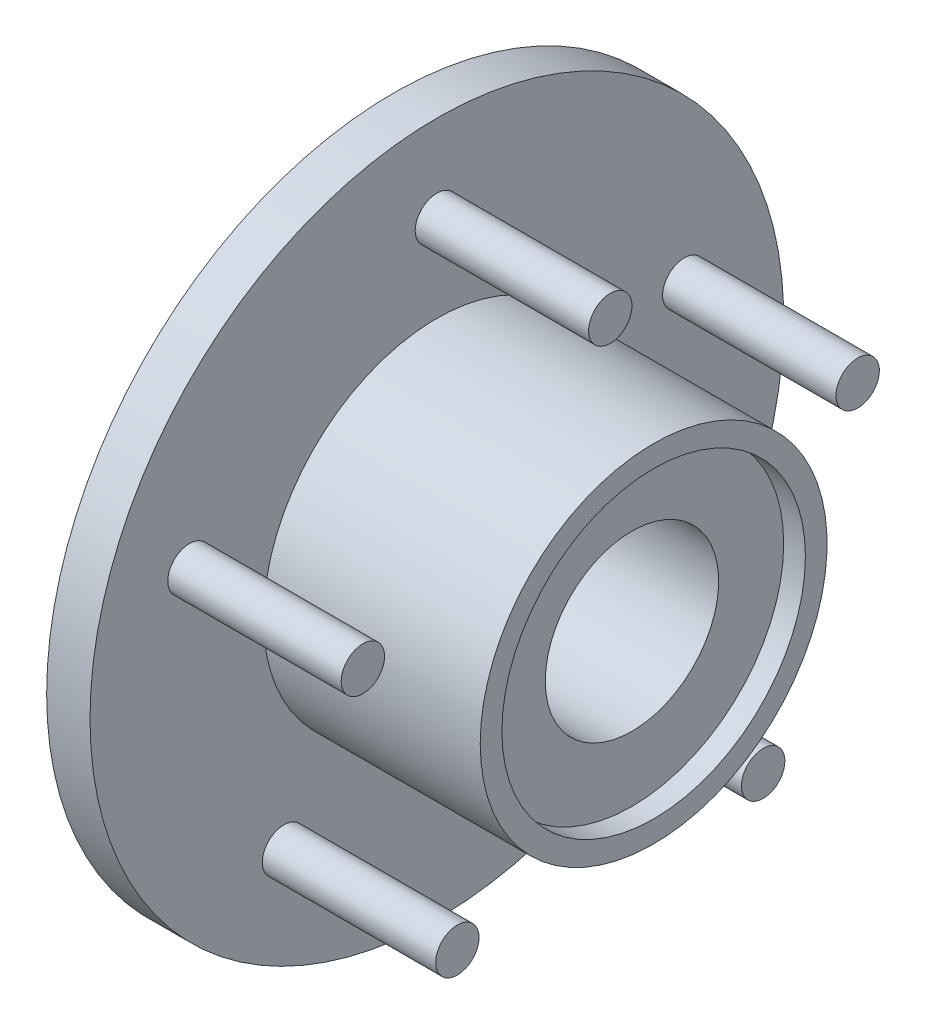
ISO-10303-21;
HEADER;
FILE_DESCRIPTION(('STEP AP214'),'2;1');
FILE_NAME('part.step','',(''),(''),'','','');
FILE_SCHEMA(('AUTOMOTIVE_DESIGN { 1 0 10303 214 1 1 1 1 }'));
ENDSEC;
DATA;
#1=APPLICATION_CONTEXT('core data for automotive mechanical design processes');
#2=APPLICATION_PROTOCOL_DEFINITION('international standard','automotive_design',2000,#1);
#3=PRODUCT_CONTEXT('',#1,'mechanical');
#4=PRODUCT('Part','Part','',(#3));
#5=PRODUCT_RELATED_PRODUCT_CATEGORY('part','',(#4));
#6=PRODUCT_DEFINITION_FORMATION('','',#4);
#7=PRODUCT_DEFINITION_CONTEXT('part definition',#1,'design');
#8=PRODUCT_DEFINITION('design','',#6,#7);
#9=PRODUCT_DEFINITION_SHAPE('','',#8);
#10=(LENGTH_UNIT() NAMED_UNIT(*) SI_UNIT(.MILLI.,.METRE.));
#11=(NAMED_UNIT(*) PLANE_ANGLE_UNIT() SI_UNIT($,.RADIAN.));
#12=(NAMED_UNIT(*) SI_UNIT($,.STERADIAN.) SOLID_ANGLE_UNIT());
#13=UNCERTAINTY_MEASURE_WITH_UNIT(LENGTH_MEASURE(1.E-05),#10,'distance_accuracy_value','');
#14=(GEOMETRIC_REPRESENTATION_CONTEXT(3) GLOBAL_UNCERTAINTY_ASSIGNED_CONTEXT((#13)) GLOBAL_UNIT_ASSIGNED_CONTEXT((#10,
#11,#12)) REPRESENTATION_CONTEXT('',''));
#15=CARTESIAN_POINT('',(0.,0.,0.));
#16=DIRECTION('',(0.,0.,1.));
#17=DIRECTION('',(1.,0.,0.));
#18=AXIS2_PLACEMENT_3D('',#15,#16,#17);
#19=CARTESIAN_POINT('',(19.05,-50.8,3.54734504026462E-13));
#20=DIRECTION('',(-1.,0.,0.));
#21=DIRECTION('',(0.,0.,1.));
#22=AXIS2_PLACEMENT_3D('',#19,#20,#21);
#23=PLANE('',#22);
#24=CARTESIAN_POINT('',(19.05,-30.8235474856853,22.3946181123435));
#25=DIRECTION('',(-1.,0.,0.));
#26=DIRECTION('',(0.,0.,1.));
#27=AXIS2_PLACEMENT_3D('',#24,#25,#26);
#28=CIRCLE('',#27,3.175);
#29=CARTESIAN_POINT('',(19.05,-30.8235474856853,25.5696181123435));
#30=VERTEX_POINT('',#29);
#31=EDGE_CURVE('E36',#30,#30,#28,.F.);
#32=ORIENTED_EDGE('',*,*,#31,.F.);
#33=EDGE_LOOP('',(#32));
#34=FACE_BOUND('',#33,.T.);
#35=CARTESIAN_POINT('',(19.05,11.7735474856854,-36.2352532708454));
#36=DIRECTION('',(-1.,0.,0.));
#37=DIRECTION('',(0.,0.,1.));
#38=AXIS2_PLACEMENT_3D('',#35,#36,#37);
#39=CIRCLE('',#38,3.175);
#40=CARTESIAN_POINT('',(19.05,11.7735474856854,-33.0602532708454));
#41=VERTEX_POINT('',#40);
#42=EDGE_CURVE('E44',#41,#41,#39,.F.);
#43=ORIENTED_EDGE('',*,*,#42,.F.);
#44=EDGE_LOOP('',(#43));
#45=FACE_BOUND('',#44,.T.);
#46=CARTESIAN_POINT('',(19.05,0.,0.));
#47=DIRECTION('',(-1.,0.,0.));
#48=DIRECTION('',(0.,0.,1.));
#49=AXIS2_PLACEMENT_3D('',#46,#47,#48);
#50=CIRCLE('',#49,25.4);
#51=CARTESIAN_POINT('',(19.05,0.,25.4));
#52=VERTEX_POINT('',#51);
#53=EDGE_CURVE('E73',#52,#52,#50,.T.);
#54=ORIENTED_EDGE('',*,*,#53,.T.);
#55=EDGE_LOOP('',(#54));
#56=FACE_BOUND('',#55,.T.);
#57=CARTESIAN_POINT('',(19.05,0.,0.));
#58=DIRECTION('',(-1.,0.,0.));
#59=DIRECTION('',(0.,0.,1.));
#60=AXIS2_PLACEMENT_3D('',#57,#58,#59);
#61=CIRCLE('',#60,50.8);
#62=CARTESIAN_POINT('',(19.05,0.,50.8));
#63=VERTEX_POINT('',#62);
#64=EDGE_CURVE('E76',#63,#63,#61,.T.);
#65=ORIENTED_EDGE('',*,*,#64,.F.);
#66=EDGE_LOOP('',(#65));
#67=FACE_BOUND('',#66,.T.);
#68=CARTESIAN_POINT('',(19.05,38.1,0.));
#69=DIRECTION('',(-1.,0.,0.));
#70=DIRECTION('',(0.,0.,1.));
#71=AXIS2_PLACEMENT_3D('',#68,#69,#70);
#72=CIRCLE('',#71,3.175);
#73=CARTESIAN_POINT('',(19.05,38.1,3.175));
#74=VERTEX_POINT('',#73);
#75=EDGE_CURVE('E49',#74,#74,#72,.F.);
#76=ORIENTED_EDGE('',*,*,#75,.F.);
#77=EDGE_LOOP('',(#76));
#78=FACE_BOUND('',#77,.T.);
#79=CARTESIAN_POINT('',(19.05,-30.8235474856856,-22.394618112343));
#80=DIRECTION('',(-1.,0.,0.));
#81=DIRECTION('',(0.,0.,1.));
#82=AXIS2_PLACEMENT_3D('',#79,#80,#81);
#83=CIRCLE('',#82,3.175);
#84=CARTESIAN_POINT('',(19.05,-30.8235474856856,-19.2196181123431));
#85=VERTEX_POINT('',#84);
#86=EDGE_CURVE('E40',#85,#85,#83,.F.);
#87=ORIENTED_EDGE('',*,*,#86,.F.);
#88=EDGE_LOOP('',(#87));
#89=FACE_BOUND('',#88,.T.);
#90=CARTESIAN_POINT('',(19.05,11.7735474856859,36.2352532708452));
#91=DIRECTION('',(-1.,0.,0.));
#92=DIRECTION('',(0.,0.,1.));
#93=AXIS2_PLACEMENT_3D('',#90,#91,#92);
#94=CIRCLE('',#93,3.175);
#95=CARTESIAN_POINT('',(19.05,11.7735474856859,39.4102532708452));
#96=VERTEX_POINT('',#95);
#97=EDGE_CURVE('E10',#96,#96,#94,.F.);
#98=ORIENTED_EDGE('',*,*,#97,.F.);
#99=EDGE_LOOP('',(#98));
#100=FACE_BOUND('',#99,.T.);
#101=ADVANCED_FACE('F29',(#34,#45,#56,#67,#78,#89,#100),#23,.F.);
#102=CARTESIAN_POINT('',(0.,-25.4,1.77367252013231E-13));
#103=DIRECTION('',(1.,0.,0.));
#104=DIRECTION('',(0.,0.,-1.));
#105=AXIS2_PLACEMENT_3D('',#102,#103,#104);
#106=PLANE('',#105);
#107=CARTESIAN_POINT('',(0.,0.,0.));
#108=DIRECTION('',(-1.,0.,0.));
#109=DIRECTION('',(0.,0.,1.));
#110=AXIS2_PLACEMENT_3D('',#107,#108,#109);
#111=CIRCLE('',#110,22.225);
#112=CARTESIAN_POINT('',(0.,0.,22.225));
#113=VERTEX_POINT('',#112);
#114=EDGE_CURVE('E52',#113,#113,#111,.T.);
#115=ORIENTED_EDGE('',*,*,#114,.F.);
#116=EDGE_LOOP('',(#115));
#117=FACE_BOUND('',#116,.T.);
#118=CARTESIAN_POINT('',(0.,0.,0.));
#119=DIRECTION('',(-1.,0.,0.));
#120=DIRECTION('',(0.,0.,1.));
#121=AXIS2_PLACEMENT_3D('',#118,#119,#120);
#122=CIRCLE('',#121,25.4);
#123=CARTESIAN_POINT('',(0.,0.,25.4));
#124=VERTEX_POINT('',#123);
#125=EDGE_CURVE('E85',#124,#124,#122,.T.);
#126=ORIENTED_EDGE('',*,*,#125,.T.);
#127=EDGE_LOOP('',(#126));
#128=FACE_BOUND('',#127,.T.);
#129=ADVANCED_FACE('F31',(#117,#128),#106,.F.);
#130=CARTESIAN_POINT('',(0.,0.,0.));
#131=DIRECTION('',(-1.,0.,0.));
#132=DIRECTION('',(0.,0.,1.));
#133=AXIS2_PLACEMENT_3D('',#130,#131,#132);
#134=CYLINDRICAL_SURFACE('',#133,22.225);
#135=CARTESIAN_POINT('',(3.175,0.,0.));
#136=DIRECTION('',(-1.,0.,0.));
#137=DIRECTION('',(0.,0.,1.));
#138=AXIS2_PLACEMENT_3D('',#135,#136,#137);
#139=CIRCLE('',#138,22.225);
#140=CARTESIAN_POINT('',(3.175,0.,22.225));
#141=VERTEX_POINT('',#140);
#142=EDGE_CURVE('E55',#141,#141,#139,.T.);
#143=ORIENTED_EDGE('',*,*,#142,.F.);
#144=EDGE_LOOP('',(#143));
#145=FACE_BOUND('',#144,.T.);
#146=ORIENTED_EDGE('',*,*,#114,.T.);
#147=EDGE_LOOP('',(#146));
#148=FACE_BOUND('',#147,.T.);
#149=ADVANCED_FACE('F124',(#145,#148),#134,.F.);
#150=CARTESIAN_POINT('',(3.175,-22.225,1.55196345511577E-13));
#151=DIRECTION('',(1.,0.,0.));
#152=DIRECTION('',(0.,0.,-1.));
#153=AXIS2_PLACEMENT_3D('',#150,#151,#152);
#154=PLANE('',#153);
#155=CARTESIAN_POINT('',(3.175,0.,0.));
#156=DIRECTION('',(-1.,0.,0.));
#157=DIRECTION('',(0.,0.,1.));
#158=AXIS2_PLACEMENT_3D('',#155,#156,#157);
#159=CIRCLE('',#158,12.7);
#160=CARTESIAN_POINT('',(3.175,0.,12.7));
#161=VERTEX_POINT('',#160);
#162=EDGE_CURVE('E58',#161,#161,#159,.T.);
#163=ORIENTED_EDGE('',*,*,#162,.F.);
#164=EDGE_LOOP('',(#163));
#165=FACE_BOUND('',#164,.T.);
#166=ORIENTED_EDGE('',*,*,#142,.T.);
#167=EDGE_LOOP('',(#166));
#168=FACE_BOUND('',#167,.T.);
#169=ADVANCED_FACE('F150',(#165,#168),#154,.F.);
#170=CARTESIAN_POINT('',(0.,0.,0.));
#171=DIRECTION('',(-1.,0.,0.));
#172=DIRECTION('',(0.,0.,1.));
#173=AXIS2_PLACEMENT_3D('',#170,#171,#172);
#174=CYLINDRICAL_SURFACE('',#173,12.7);
#175=CARTESIAN_POINT('',(47.625,0.,0.));
#176=DIRECTION('',(-1.,0.,0.));
#177=DIRECTION('',(0.,0.,1.));
#178=AXIS2_PLACEMENT_3D('',#175,#176,#177);
#179=CIRCLE('',#178,12.7);
#180=CARTESIAN_POINT('',(47.625,0.,12.7));
#181=VERTEX_POINT('',#180);
#182=EDGE_CURVE('E61',#181,#181,#179,.T.);
#183=ORIENTED_EDGE('',*,*,#182,.F.);
#184=EDGE_LOOP('',(#183));
#185=FACE_BOUND('',#184,.T.);
#186=ORIENTED_EDGE('',*,*,#162,.T.);
#187=EDGE_LOOP('',(#186));
#188=FACE_BOUND('',#187,.T.);
#189=ADVANCED_FACE('F146',(#185,#188),#174,.F.);
#190=CARTESIAN_POINT('',(47.625,-22.225,1.55196345511577E-13));
#191=DIRECTION('',(-1.,0.,0.));
#192=DIRECTION('',(0.,0.,1.));
#193=AXIS2_PLACEMENT_3D('',#190,#191,#192);
#194=PLANE('',#193);
#195=CARTESIAN_POINT('',(47.625,0.,0.));
#196=DIRECTION('',(-1.,0.,0.));
#197=DIRECTION('',(0.,0.,1.));
#198=AXIS2_PLACEMENT_3D('',#195,#196,#197);
#199=CIRCLE('',#198,22.225);
#200=CARTESIAN_POINT('',(47.625,0.,22.225));
#201=VERTEX_POINT('',#200);
#202=EDGE_CURVE('E64',#201,#201,#199,.T.);
#203=ORIENTED_EDGE('',*,*,#202,.F.);
#204=EDGE_LOOP('',(#203));
#205=FACE_BOUND('',#204,.T.);
#206=ORIENTED_EDGE('',*,*,#182,.T.);
#207=EDGE_LOOP('',(#206));
#208=FACE_BOUND('',#207,.T.);
#209=ADVANCED_FACE('F142',(#205,#208),#194,.F.);
#210=CARTESIAN_POINT('',(0.,0.,0.));
#211=DIRECTION('',(-1.,0.,0.));
#212=DIRECTION('',(0.,0.,1.));
#213=AXIS2_PLACEMENT_3D('',#210,#211,#212);
#214=CYLINDRICAL_SURFACE('',#213,22.225);
#215=CARTESIAN_POINT('',(50.8,0.,0.));
#216=DIRECTION('',(-1.,0.,0.));
#217=DIRECTION('',(0.,0.,1.));
#218=AXIS2_PLACEMENT_3D('',#215,#216,#217);
#219=CIRCLE('',#218,22.225);
#220=CARTESIAN_POINT('',(50.8,0.,22.225));
#221=VERTEX_POINT('',#220);
#222=EDGE_CURVE('E67',#221,#221,#219,.T.);
#223=ORIENTED_EDGE('',*,*,#222,.F.);
#224=EDGE_LOOP('',(#223));
#225=FACE_BOUND('',#224,.T.);
#226=ORIENTED_EDGE('',*,*,#202,.T.);
#227=EDGE_LOOP('',(#226));
#228=FACE_BOUND('',#227,.T.);
#229=ADVANCED_FACE('F138',(#225,#228),#214,.F.);
#230=CARTESIAN_POINT('',(50.8,-25.4,1.77367252013231E-13));
#231=DIRECTION('',(-1.,0.,0.));
#232=DIRECTION('',(0.,0.,1.));
#233=AXIS2_PLACEMENT_3D('',#230,#231,#232);
#234=PLANE('',#233);
#235=CARTESIAN_POINT('',(50.8,0.,0.));
#236=DIRECTION('',(-1.,0.,0.));
#237=DIRECTION('',(0.,0.,1.));
#238=AXIS2_PLACEMENT_3D('',#235,#236,#237);
#239=CIRCLE('',#238,25.4);
#240=CARTESIAN_POINT('',(50.8,0.,25.4));
#241=VERTEX_POINT('',#240);
#242=EDGE_CURVE('E70',#241,#241,#239,.T.);
#243=ORIENTED_EDGE('',*,*,#242,.F.);
#244=EDGE_LOOP('',(#243));
#245=FACE_BOUND('',#244,.T.);
#246=ORIENTED_EDGE('',*,*,#222,.T.);
#247=EDGE_LOOP('',(#246));
#248=FACE_BOUND('',#247,.T.);
#249=ADVANCED_FACE('F134',(#245,#248),#234,.F.);
#250=CARTESIAN_POINT('',(0.,0.,0.));
#251=DIRECTION('',(-1.,0.,0.));
#252=DIRECTION('',(0.,0.,1.));
#253=AXIS2_PLACEMENT_3D('',#250,#251,#252);
#254=CYLINDRICAL_SURFACE('',#253,25.4);
#255=ORIENTED_EDGE('',*,*,#53,.F.);
#256=EDGE_LOOP('',(#255));
#257=FACE_BOUND('',#256,.T.);
#258=ORIENTED_EDGE('',*,*,#242,.T.);
#259=EDGE_LOOP('',(#258));
#260=FACE_BOUND('',#259,.T.);
#261=ADVANCED_FACE('F131',(#257,#260),#254,.T.);
#262=CARTESIAN_POINT('',(0.,0.,0.));
#263=DIRECTION('',(-1.,0.,0.));
#264=DIRECTION('',(0.,0.,1.));
#265=AXIS2_PLACEMENT_3D('',#262,#263,#264);
#266=CYLINDRICAL_SURFACE('',#265,50.8);
#267=CARTESIAN_POINT('',(12.7,0.,0.));
#268=DIRECTION('',(-1.,0.,0.));
#269=DIRECTION('',(0.,0.,1.));
#270=AXIS2_PLACEMENT_3D('',#267,#268,#269);
#271=CIRCLE('',#270,50.8);
#272=CARTESIAN_POINT('',(12.7,0.,50.8));
#273=VERTEX_POINT('',#272);
#274=EDGE_CURVE('E79',#273,#273,#271,.T.);
#275=ORIENTED_EDGE('',*,*,#274,.F.);
#276=EDGE_LOOP('',(#275));
#277=FACE_BOUND('',#276,.T.);
#278=ORIENTED_EDGE('',*,*,#64,.T.);
#279=EDGE_LOOP('',(#278));
#280=FACE_BOUND('',#279,.T.);
#281=ADVANCED_FACE('F129',(#277,#280),#266,.T.);
#282=CARTESIAN_POINT('',(12.7,-25.4,1.77367252013231E-13));
#283=DIRECTION('',(1.,0.,0.));
#284=DIRECTION('',(0.,0.,-1.));
#285=AXIS2_PLACEMENT_3D('',#282,#283,#284);
#286=PLANE('',#285);
#287=CARTESIAN_POINT('',(12.7,0.,0.));
#288=DIRECTION('',(-1.,0.,0.));
#289=DIRECTION('',(0.,0.,1.));
#290=AXIS2_PLACEMENT_3D('',#287,#288,#289);
#291=CIRCLE('',#290,25.4);
#292=CARTESIAN_POINT('',(12.7,0.,25.4));
#293=VERTEX_POINT('',#292);
#294=EDGE_CURVE('E82',#293,#293,#291,.T.);
#295=ORIENTED_EDGE('',*,*,#294,.F.);
#296=EDGE_LOOP('',(#295));
#297=FACE_BOUND('',#296,.T.);
#298=ORIENTED_EDGE('',*,*,#274,.T.);
#299=EDGE_LOOP('',(#298));
#300=FACE_BOUND('',#299,.T.);
#301=ADVANCED_FACE('F168',(#297,#300),#286,.F.);
#302=CARTESIAN_POINT('',(0.,0.,0.));
#303=DIRECTION('',(-1.,0.,0.));
#304=DIRECTION('',(0.,0.,1.));
#305=AXIS2_PLACEMENT_3D('',#302,#303,#304);
#306=CYLINDRICAL_SURFACE('',#305,25.4);
#307=ORIENTED_EDGE('',*,*,#125,.F.);
#308=EDGE_LOOP('',(#307));
#309=FACE_BOUND('',#308,.T.);
#310=ORIENTED_EDGE('',*,*,#294,.T.);
#311=EDGE_LOOP('',(#310));
#312=FACE_BOUND('',#311,.T.);
#313=ADVANCED_FACE('F164',(#309,#312),#306,.T.);
#314=CARTESIAN_POINT('',(44.45,38.1,0.));
#315=DIRECTION('',(-1.,0.,0.));
#316=DIRECTION('',(0.,0.,1.));
#317=AXIS2_PLACEMENT_3D('',#314,#315,#316);
#318=CYLINDRICAL_SURFACE('',#317,3.175);
#319=CARTESIAN_POINT('',(44.45,38.1,0.));
#320=DIRECTION('',(1.,0.,0.));
#321=DIRECTION('',(0.,0.,-1.));
#322=AXIS2_PLACEMENT_3D('',#319,#320,#321);
#323=CIRCLE('',#322,3.175);
#324=CARTESIAN_POINT('',(44.45,38.1,-3.175));
#325=VERTEX_POINT('',#324);
#326=EDGE_CURVE('E88',#325,#325,#323,.T.);
#327=ORIENTED_EDGE('',*,*,#326,.F.);
#328=EDGE_LOOP('',(#327));
#329=FACE_BOUND('',#328,.T.);
#330=ORIENTED_EDGE('',*,*,#75,.T.);
#331=EDGE_LOOP('',(#330));
#332=FACE_BOUND('',#331,.T.);
#333=ADVANCED_FACE('F167',(#329,#332),#318,.T.);
#334=CARTESIAN_POINT('',(44.45,38.1,0.));
#335=DIRECTION('',(1.,0.,0.));
#336=DIRECTION('',(0.,0.,-1.));
#337=AXIS2_PLACEMENT_3D('',#334,#335,#336);
#338=PLANE('',#337);
#339=ORIENTED_EDGE('',*,*,#326,.T.);
#340=EDGE_LOOP('',(#339));
#341=FACE_BOUND('',#340,.T.);
#342=ADVANCED_FACE('F206',(#341),#338,.T.);
#343=CARTESIAN_POINT('',(44.45,11.7735474856854,-36.2352532708454));
#344=DIRECTION('',(-1.,0.,0.));
#345=DIRECTION('',(0.,0.,1.));
#346=AXIS2_PLACEMENT_3D('',#343,#344,#345);
#347=CYLINDRICAL_SURFACE('',#346,3.175);
#348=CARTESIAN_POINT('',(44.45,11.7735474856854,-36.2352532708454));
#349=DIRECTION('',(1.,0.,0.));
#350=DIRECTION('',(0.,-0.951056516295155,-0.309016994374945));
#351=AXIS2_PLACEMENT_3D('',#348,#349,#350);
#352=CIRCLE('',#351,3.175);
#353=CARTESIAN_POINT('',(44.45,8.75394304644828,-37.2163822279858));
#354=VERTEX_POINT('',#353);
#355=EDGE_CURVE('E91',#354,#354,#352,.T.);
#356=ORIENTED_EDGE('',*,*,#355,.F.);
#357=EDGE_LOOP('',(#356));
#358=FACE_BOUND('',#357,.T.);
#359=ORIENTED_EDGE('',*,*,#42,.T.);
#360=EDGE_LOOP('',(#359));
#361=FACE_BOUND('',#360,.T.);
#362=ADVANCED_FACE('F198',(#358,#361),#347,.T.);
#363=CARTESIAN_POINT('',(44.45,11.7735474856854,-36.2352532708454));
#364=DIRECTION('',(1.,0.,0.));
#365=DIRECTION('',(0.,-0.951056516295155,-0.309016994374945));
#366=AXIS2_PLACEMENT_3D('',#363,#364,#365);
#367=PLANE('',#366);
#368=ORIENTED_EDGE('',*,*,#355,.T.);
#369=EDGE_LOOP('',(#368));
#370=FACE_BOUND('',#369,.T.);
#371=ADVANCED_FACE('F189',(#370),#367,.T.);
#372=CARTESIAN_POINT('',(44.45,-30.8235474856856,-22.394618112343));
#373=DIRECTION('',(-1.,0.,0.));
#374=DIRECTION('',(0.,0.,1.));
#375=AXIS2_PLACEMENT_3D('',#372,#373,#374);
#376=CYLINDRICAL_SURFACE('',#375,3.175);
#377=CARTESIAN_POINT('',(44.45,-30.8235474856856,-22.394618112343));
#378=DIRECTION('',(1.,0.,0.));
#379=DIRECTION('',(0.,-0.587785252292469,0.809016994374951));
#380=AXIS2_PLACEMENT_3D('',#377,#378,#379);
#381=CIRCLE('',#380,3.175);
#382=CARTESIAN_POINT('',(44.45,-32.6897656617142,-19.8259891552026));
#383=VERTEX_POINT('',#382);
#384=EDGE_CURVE('E94',#383,#383,#381,.T.);
#385=ORIENTED_EDGE('',*,*,#384,.F.);
#386=EDGE_LOOP('',(#385));
#387=FACE_BOUND('',#386,.T.);
#388=ORIENTED_EDGE('',*,*,#86,.T.);
#389=EDGE_LOOP('',(#388));
#390=FACE_BOUND('',#389,.T.);
#391=ADVANCED_FACE('F186',(#387,#390),#376,.T.);
#392=CARTESIAN_POINT('',(44.45,-30.8235474856856,-22.394618112343));
#393=DIRECTION('',(1.,0.,0.));
#394=DIRECTION('',(0.,-0.587785252292469,0.809016994374951));
#395=AXIS2_PLACEMENT_3D('',#392,#393,#394);
#396=PLANE('',#395);
#397=ORIENTED_EDGE('',*,*,#384,.T.);
#398=EDGE_LOOP('',(#397));
#399=FACE_BOUND('',#398,.T.);
#400=ADVANCED_FACE('F188',(#399),#396,.T.);
#401=CARTESIAN_POINT('',(44.45,-30.8235474856853,22.3946181123435));
#402=DIRECTION('',(-1.,0.,0.));
#403=DIRECTION('',(0.,0.,1.));
#404=AXIS2_PLACEMENT_3D('',#401,#402,#403);
#405=CYLINDRICAL_SURFACE('',#404,3.175);
#406=CARTESIAN_POINT('',(44.45,-30.8235474856853,22.3946181123435));
#407=DIRECTION('',(1.,0.,0.));
#408=DIRECTION('',(0.,0.58778525229248,0.809016994374942));
#409=AXIS2_PLACEMENT_3D('',#406,#407,#408);
#410=CIRCLE('',#409,3.175);
#411=CARTESIAN_POINT('',(44.45,-28.9573293096567,24.9632470694839));
#412=VERTEX_POINT('',#411);
#413=EDGE_CURVE('E97',#412,#412,#410,.T.);
#414=ORIENTED_EDGE('',*,*,#413,.F.);
#415=EDGE_LOOP('',(#414));
#416=FACE_BOUND('',#415,.T.);
#417=ORIENTED_EDGE('',*,*,#31,.T.);
#418=EDGE_LOOP('',(#417));
#419=FACE_BOUND('',#418,.T.);
#420=ADVANCED_FACE('F115',(#416,#419),#405,.T.);
#421=CARTESIAN_POINT('',(44.45,-30.8235474856853,22.3946181123435));
#422=DIRECTION('',(1.,0.,0.));
#423=DIRECTION('',(0.,0.58778525229248,0.809016994374942));
#424=AXIS2_PLACEMENT_3D('',#421,#422,#423);
#425=PLANE('',#424);
#426=ORIENTED_EDGE('',*,*,#413,.T.);
#427=EDGE_LOOP('',(#426));
#428=FACE_BOUND('',#427,.T.);
#429=ADVANCED_FACE('F108',(#428),#425,.T.);
#430=CARTESIAN_POINT('',(44.45,11.7735474856859,36.2352532708452));
#431=DIRECTION('',(-1.,0.,0.));
#432=DIRECTION('',(0.,0.,1.));
#433=AXIS2_PLACEMENT_3D('',#430,#431,#432);
#434=CYLINDRICAL_SURFACE('',#433,3.175);
#435=CARTESIAN_POINT('',(44.45,11.7735474856859,36.2352532708452));
#436=DIRECTION('',(1.,0.,0.));
#437=DIRECTION('',(0.,0.95105651629515,-0.309016994374958));
#438=AXIS2_PLACEMENT_3D('',#435,#436,#437);
#439=CIRCLE('',#438,3.175);
#440=CARTESIAN_POINT('',(44.45,14.793151924923,35.2541243137047));
#441=VERTEX_POINT('',#440);
#442=EDGE_CURVE('E100',#441,#441,#439,.T.);
#443=ORIENTED_EDGE('',*,*,#442,.F.);
#444=EDGE_LOOP('',(#443));
#445=FACE_BOUND('',#444,.T.);
#446=ORIENTED_EDGE('',*,*,#97,.T.);
#447=EDGE_LOOP('',(#446));
#448=FACE_BOUND('',#447,.T.);
#449=ADVANCED_FACE('F106',(#445,#448),#434,.T.);
#450=CARTESIAN_POINT('',(44.45,11.7735474856859,36.2352532708452));
#451=DIRECTION('',(1.,0.,0.));
#452=DIRECTION('',(0.,0.95105651629515,-0.309016994374958));
#453=AXIS2_PLACEMENT_3D('',#450,#451,#452);
#454=PLANE('',#453);
#455=ORIENTED_EDGE('',*,*,#442,.T.);
#456=EDGE_LOOP('',(#455));
#457=FACE_BOUND('',#456,.T.);
#458=ADVANCED_FACE('F104',(#457),#454,.T.);
#459=CLOSED_SHELL('',(#101,#129,#149,#169,#189,#209,#229,#249,#261,#281,#301,#313,#333,#342,
#362,#371,#391,#400,#420,#429,#449,#458));
#460=MANIFOLD_SOLID_BREP('B2',#459);
#461=ADVANCED_BREP_SHAPE_REPRESENTATION('',(#18,#460),#14);
#462=SHAPE_DEFINITION_REPRESENTATION(#9,#461);
ENDSEC;
END-ISO-10303-21;
